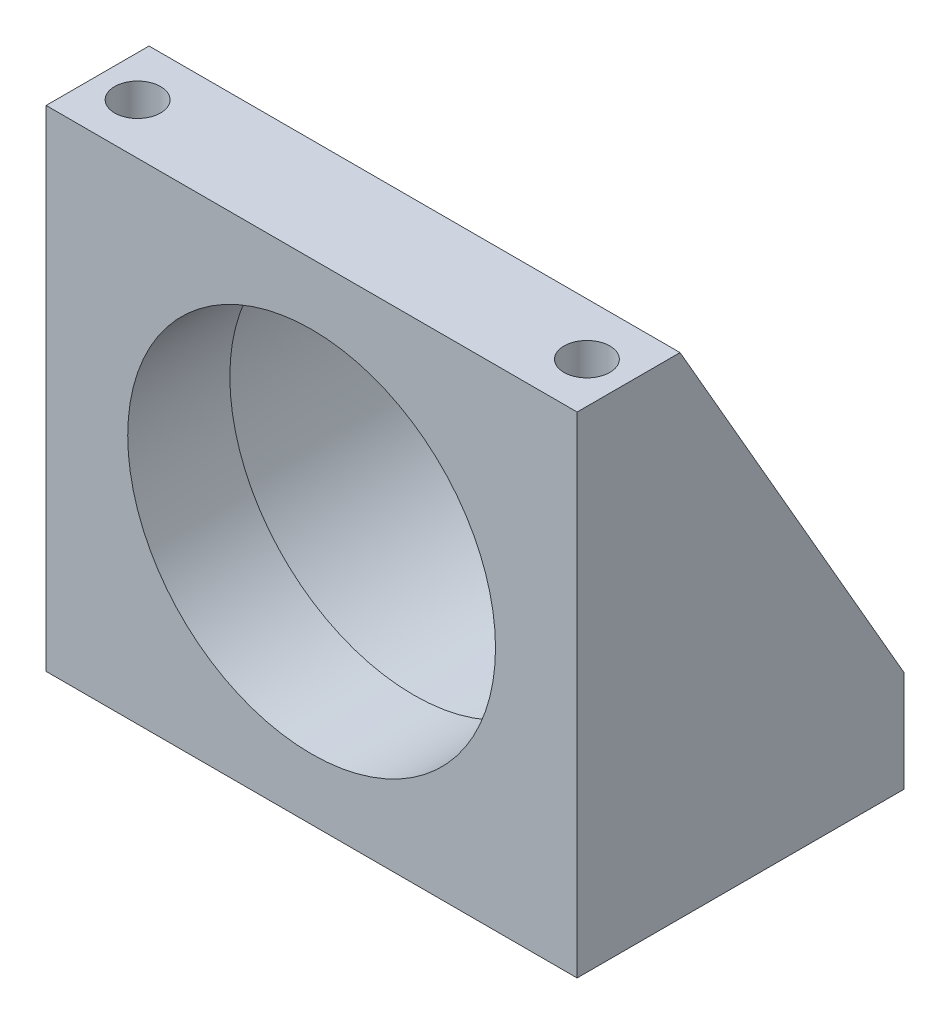
ISO-10303-21;
HEADER;
FILE_DESCRIPTION(('STEP AP214'),'2;1');
FILE_NAME('part.step','',(''),(''),'','','');
FILE_SCHEMA(('AUTOMOTIVE_DESIGN { 1 0 10303 214 1 1 1 1 }'));
ENDSEC;
DATA;
#1=APPLICATION_CONTEXT('core data for automotive mechanical design processes');
#2=APPLICATION_PROTOCOL_DEFINITION('international standard','automotive_design',2000,#1);
#3=PRODUCT_CONTEXT('',#1,'mechanical');
#4=PRODUCT('Part','Part','',(#3));
#5=PRODUCT_RELATED_PRODUCT_CATEGORY('part','',(#4));
#6=PRODUCT_DEFINITION_FORMATION('','',#4);
#7=PRODUCT_DEFINITION_CONTEXT('part definition',#1,'design');
#8=PRODUCT_DEFINITION('design','',#6,#7);
#9=PRODUCT_DEFINITION_SHAPE('','',#8);
#10=(LENGTH_UNIT() NAMED_UNIT(*) SI_UNIT(.MILLI.,.METRE.));
#11=(NAMED_UNIT(*) PLANE_ANGLE_UNIT() SI_UNIT($,.RADIAN.));
#12=(NAMED_UNIT(*) SI_UNIT($,.STERADIAN.) SOLID_ANGLE_UNIT());
#13=UNCERTAINTY_MEASURE_WITH_UNIT(LENGTH_MEASURE(1.E-05),#10,'distance_accuracy_value','');
#14=(GEOMETRIC_REPRESENTATION_CONTEXT(3) GLOBAL_UNCERTAINTY_ASSIGNED_CONTEXT((#13)) GLOBAL_UNIT_ASSIGNED_CONTEXT((#10,
#11,#12)) REPRESENTATION_CONTEXT('',''));
#15=CARTESIAN_POINT('',(0.,0.,0.));
#16=DIRECTION('',(0.,0.,1.));
#17=DIRECTION('',(1.,0.,0.));
#18=AXIS2_PLACEMENT_3D('',#15,#16,#17);
#19=CARTESIAN_POINT('',(-41.275,76.2,-50.8));
#20=DIRECTION('',(-1.,0.,0.));
#21=DIRECTION('',(0.,-1.,0.));
#22=AXIS2_PLACEMENT_3D('',#19,#20,#21);
#23=PLANE('',#22);
#24=DIRECTION('',(0.,-0.86667016874231,-0.498881567721414));
#25=VECTOR('',#24,1.);
#26=CARTESIAN_POINT('',(-41.275,76.2,-16.002));
#27=LINE('',#26,#25);
#28=CARTESIAN_POINT('',(-41.275,76.2,-16.002));
#29=VERTEX_POINT('',#28);
#30=CARTESIAN_POINT('',(-41.275,15.748,-50.8));
#31=VERTEX_POINT('',#30);
#32=EDGE_CURVE('E192',#29,#31,#27,.T.);
#33=ORIENTED_EDGE('',*,*,#32,.T.);
#34=DIRECTION('',(0.,-1.,0.));
#35=VECTOR('',#34,1.);
#36=CARTESIAN_POINT('',(-41.275,76.2,-50.8));
#37=LINE('',#36,#35);
#38=CARTESIAN_POINT('',(-41.275,0.,-50.8));
#39=VERTEX_POINT('',#38);
#40=EDGE_CURVE('E105',#31,#39,#37,.T.);
#41=ORIENTED_EDGE('',*,*,#40,.T.);
#42=DIRECTION('',(0.,0.,1.));
#43=VECTOR('',#42,1.);
#44=CARTESIAN_POINT('',(-41.275,0.,-50.8));
#45=LINE('',#44,#43);
#46=CARTESIAN_POINT('',(-41.275,0.,0.));
#47=VERTEX_POINT('',#46);
#48=EDGE_CURVE('E95',#39,#47,#45,.T.);
#49=ORIENTED_EDGE('',*,*,#48,.T.);
#50=DIRECTION('',(0.,-1.,0.));
#51=VECTOR('',#50,1.);
#52=CARTESIAN_POINT('',(-41.275,76.2,0.));
#53=LINE('',#52,#51);
#54=CARTESIAN_POINT('',(-41.275,76.2,0.));
#55=VERTEX_POINT('',#54);
#56=EDGE_CURVE('E93',#55,#47,#53,.T.);
#57=ORIENTED_EDGE('',*,*,#56,.F.);
#58=DIRECTION('',(0.,0.,1.));
#59=VECTOR('',#58,1.);
#60=CARTESIAN_POINT('',(-41.275,76.2,-50.8));
#61=LINE('',#60,#59);
#62=EDGE_CURVE('E78',#29,#55,#61,.T.);
#63=ORIENTED_EDGE('',*,*,#62,.F.);
#64=EDGE_LOOP('',(#33,#41,#49,#57,#63));
#65=FACE_BOUND('',#64,.T.);
#66=ADVANCED_FACE('F35',(#65),#23,.T.);
#67=CARTESIAN_POINT('',(-41.275,76.2,-50.8));
#68=DIRECTION('',(0.,1.,0.));
#69=DIRECTION('',(0.,0.,1.));
#70=AXIS2_PLACEMENT_3D('',#67,#68,#69);
#71=PLANE('',#70);
#72=CARTESIAN_POINT('',(-34.925,76.2,-7.874));
#73=DIRECTION('',(0.,1.,0.));
#74=DIRECTION('',(0.,0.,1.));
#75=AXIS2_PLACEMENT_3D('',#72,#73,#74);
#76=CIRCLE('',#75,3.56870000000001);
#77=CARTESIAN_POINT('',(-34.925,76.2,-4.30529999999998));
#78=VERTEX_POINT('',#77);
#79=EDGE_CURVE('E178',#78,#78,#76,.T.);
#80=ORIENTED_EDGE('',*,*,#79,.F.);
#81=EDGE_LOOP('',(#80));
#82=FACE_BOUND('',#81,.T.);
#83=CARTESIAN_POINT('',(34.925,76.2,-7.874));
#84=DIRECTION('',(0.,1.,0.));
#85=DIRECTION('',(0.,0.,1.));
#86=AXIS2_PLACEMENT_3D('',#83,#84,#85);
#87=CIRCLE('',#86,3.56870000000001);
#88=CARTESIAN_POINT('',(34.925,76.2,-4.30529999999998));
#89=VERTEX_POINT('',#88);
#90=EDGE_CURVE('E182',#89,#89,#87,.T.);
#91=ORIENTED_EDGE('',*,*,#90,.F.);
#92=EDGE_LOOP('',(#91));
#93=FACE_BOUND('',#92,.T.);
#94=DIRECTION('',(1.,0.,0.));
#95=VECTOR('',#94,1.);
#96=CARTESIAN_POINT('',(-41.275,76.2,-16.002));
#97=LINE('',#96,#95);
#98=CARTESIAN_POINT('',(41.275,76.2,-16.002));
#99=VERTEX_POINT('',#98);
#100=EDGE_CURVE('E86',#29,#99,#97,.T.);
#101=ORIENTED_EDGE('',*,*,#100,.F.);
#102=ORIENTED_EDGE('',*,*,#62,.T.);
#103=DIRECTION('',(-1.,0.,0.));
#104=VECTOR('',#103,1.);
#105=CARTESIAN_POINT('',(-41.275,76.2,0.));
#106=LINE('',#105,#104);
#107=CARTESIAN_POINT('',(41.275,76.2,0.));
#108=VERTEX_POINT('',#107);
#109=EDGE_CURVE('E83',#108,#55,#106,.T.);
#110=ORIENTED_EDGE('',*,*,#109,.F.);
#111=DIRECTION('',(0.,0.,1.));
#112=VECTOR('',#111,1.);
#113=CARTESIAN_POINT('',(41.275,76.2,-50.8));
#114=LINE('',#113,#112);
#115=EDGE_CURVE('E90',#99,#108,#114,.T.);
#116=ORIENTED_EDGE('',*,*,#115,.F.);
#117=EDGE_LOOP('',(#101,#102,#110,#116));
#118=FACE_BOUND('',#117,.T.);
#119=ADVANCED_FACE('F80',(#82,#93,#118),#71,.T.);
#120=CARTESIAN_POINT('',(41.275,76.2,-50.8));
#121=DIRECTION('',(1.,0.,0.));
#122=DIRECTION('',(0.,1.,0.));
#123=AXIS2_PLACEMENT_3D('',#120,#121,#122);
#124=PLANE('',#123);
#125=DIRECTION('',(0.,-0.86667016874231,-0.498881567721414));
#126=VECTOR('',#125,1.);
#127=CARTESIAN_POINT('',(41.275,76.2,-16.002));
#128=LINE('',#127,#126);
#129=CARTESIAN_POINT('',(41.275,15.748,-50.8));
#130=VERTEX_POINT('',#129);
#131=EDGE_CURVE('E119',#99,#130,#128,.T.);
#132=ORIENTED_EDGE('',*,*,#131,.F.);
#133=ORIENTED_EDGE('',*,*,#115,.T.);
#134=DIRECTION('',(0.,1.,0.));
#135=VECTOR('',#134,1.);
#136=CARTESIAN_POINT('',(41.275,76.2,0.));
#137=LINE('',#136,#135);
#138=CARTESIAN_POINT('',(41.275,0.,0.));
#139=VERTEX_POINT('',#138);
#140=EDGE_CURVE('E104',#139,#108,#137,.T.);
#141=ORIENTED_EDGE('',*,*,#140,.F.);
#142=DIRECTION('',(0.,0.,1.));
#143=VECTOR('',#142,1.);
#144=CARTESIAN_POINT('',(41.275,0.,-50.8));
#145=LINE('',#144,#143);
#146=CARTESIAN_POINT('',(41.275,0.,-50.8));
#147=VERTEX_POINT('',#146);
#148=EDGE_CURVE('E58',#147,#139,#145,.T.);
#149=ORIENTED_EDGE('',*,*,#148,.F.);
#150=DIRECTION('',(0.,1.,0.));
#151=VECTOR('',#150,1.);
#152=CARTESIAN_POINT('',(41.275,76.2,-50.8));
#153=LINE('',#152,#151);
#154=EDGE_CURVE('E115',#147,#130,#153,.T.);
#155=ORIENTED_EDGE('',*,*,#154,.T.);
#156=EDGE_LOOP('',(#132,#133,#141,#149,#155));
#157=FACE_BOUND('',#156,.T.);
#158=ADVANCED_FACE('F144',(#157),#124,.T.);
#159=CARTESIAN_POINT('',(-41.275,0.,-50.8));
#160=DIRECTION('',(0.,-1.,0.));
#161=DIRECTION('',(0.,0.,-1.));
#162=AXIS2_PLACEMENT_3D('',#159,#160,#161);
#163=PLANE('',#162);
#164=CARTESIAN_POINT('',(-34.925,0.,-7.874));
#165=DIRECTION('',(0.,-1.,0.));
#166=DIRECTION('',(0.,0.,-1.));
#167=AXIS2_PLACEMENT_3D('',#164,#165,#166);
#168=CIRCLE('',#167,3.56870000000001);
#169=CARTESIAN_POINT('',(-34.925,0.,-11.4427));
#170=VERTEX_POINT('',#169);
#171=EDGE_CURVE('E181',#170,#170,#168,.T.);
#172=ORIENTED_EDGE('',*,*,#171,.F.);
#173=EDGE_LOOP('',(#172));
#174=FACE_BOUND('',#173,.T.);
#175=CARTESIAN_POINT('',(34.925,0.,-7.874));
#176=DIRECTION('',(0.,-1.,0.));
#177=DIRECTION('',(0.,0.,-1.));
#178=AXIS2_PLACEMENT_3D('',#175,#176,#177);
#179=CIRCLE('',#178,3.56870000000001);
#180=CARTESIAN_POINT('',(34.925,0.,-11.4427));
#181=VERTEX_POINT('',#180);
#182=EDGE_CURVE('E185',#181,#181,#179,.T.);
#183=ORIENTED_EDGE('',*,*,#182,.F.);
#184=EDGE_LOOP('',(#183));
#185=FACE_BOUND('',#184,.T.);
#186=DIRECTION('',(1.,0.,0.));
#187=VECTOR('',#186,1.);
#188=CARTESIAN_POINT('',(-41.275,0.,0.));
#189=LINE('',#188,#187);
#190=EDGE_CURVE('E99',#47,#139,#189,.T.);
#191=ORIENTED_EDGE('',*,*,#190,.F.);
#192=ORIENTED_EDGE('',*,*,#48,.F.);
#193=DIRECTION('',(1.,0.,0.));
#194=VECTOR('',#193,1.);
#195=CARTESIAN_POINT('',(-41.275,0.,-50.8));
#196=LINE('',#195,#194);
#197=EDGE_CURVE('E107',#39,#147,#196,.T.);
#198=ORIENTED_EDGE('',*,*,#197,.T.);
#199=ORIENTED_EDGE('',*,*,#148,.T.);
#200=EDGE_LOOP('',(#191,#192,#198,#199));
#201=FACE_BOUND('',#200,.T.);
#202=ADVANCED_FACE('F148',(#174,#185,#201),#163,.T.);
#203=CARTESIAN_POINT('',(-41.275,0.,-50.8));
#204=DIRECTION('',(0.,0.,1.));
#205=DIRECTION('',(1.,0.,0.));
#206=AXIS2_PLACEMENT_3D('',#203,#204,#205);
#207=PLANE('',#206);
#208=DIRECTION('',(1.,0.,0.));
#209=VECTOR('',#208,1.);
#210=CARTESIAN_POINT('',(-41.275,15.748,-50.8));
#211=LINE('',#210,#209);
#212=CARTESIAN_POINT('',(-21.4626242570661,15.748,-50.8));
#213=VERTEX_POINT('',#212);
#214=EDGE_CURVE('E196',#31,#213,#211,.T.);
#215=ORIENTED_EDGE('',*,*,#214,.T.);
#216=CARTESIAN_POINT('',(0.,38.1,-50.8));
#217=DIRECTION('',(0.,0.,-1.));
#218=DIRECTION('',(-1.,0.,0.));
#219=AXIS2_PLACEMENT_3D('',#216,#217,#218);
#220=CIRCLE('',#219,30.988);
#221=CARTESIAN_POINT('',(21.4626242570661,15.748,-50.8));
#222=VERTEX_POINT('',#221);
#223=EDGE_CURVE('E49',#222,#213,#220,.T.);
#224=ORIENTED_EDGE('',*,*,#223,.F.);
#225=EDGE_CURVE('E199',#222,#130,#211,.T.);
#226=ORIENTED_EDGE('',*,*,#225,.T.);
#227=ORIENTED_EDGE('',*,*,#154,.F.);
#228=ORIENTED_EDGE('',*,*,#197,.F.);
#229=ORIENTED_EDGE('',*,*,#40,.F.);
#230=EDGE_LOOP('',(#215,#224,#226,#227,#228,#229));
#231=FACE_BOUND('',#230,.T.);
#232=ADVANCED_FACE('F151',(#231),#207,.F.);
#233=CARTESIAN_POINT('',(-41.275,0.,0.));
#234=DIRECTION('',(0.,0.,1.));
#235=DIRECTION('',(1.,0.,0.));
#236=AXIS2_PLACEMENT_3D('',#233,#234,#235);
#237=PLANE('',#236);
#238=CARTESIAN_POINT('',(0.,38.1,0.));
#239=DIRECTION('',(0.,0.,1.));
#240=DIRECTION('',(1.,0.,0.));
#241=AXIS2_PLACEMENT_3D('',#238,#239,#240);
#242=CIRCLE('',#241,28.5877);
#243=CARTESIAN_POINT('',(28.5877,38.1,0.));
#244=VERTEX_POINT('',#243);
#245=EDGE_CURVE('E100',#244,#244,#242,.T.);
#246=ORIENTED_EDGE('',*,*,#245,.F.);
#247=EDGE_LOOP('',(#246));
#248=FACE_BOUND('',#247,.T.);
#249=ORIENTED_EDGE('',*,*,#56,.T.);
#250=ORIENTED_EDGE('',*,*,#190,.T.);
#251=ORIENTED_EDGE('',*,*,#140,.T.);
#252=ORIENTED_EDGE('',*,*,#109,.T.);
#253=EDGE_LOOP('',(#249,#250,#251,#252));
#254=FACE_BOUND('',#253,.T.);
#255=ADVANCED_FACE('F103',(#248,#254),#237,.T.);
#256=CARTESIAN_POINT('',(0.,38.1,-50.8));
#257=DIRECTION('',(0.,0.,1.));
#258=DIRECTION('',(1.,0.,0.));
#259=AXIS2_PLACEMENT_3D('',#256,#257,#258);
#260=CYLINDRICAL_SURFACE('',#259,28.5877);
#261=CARTESIAN_POINT('',(0.,38.1,-15.875));
#262=DIRECTION('',(0.,0.,1.));
#263=DIRECTION('',(1.,0.,0.));
#264=AXIS2_PLACEMENT_3D('',#261,#262,#263);
#265=CIRCLE('',#264,28.5877);
#266=CARTESIAN_POINT('',(28.5877,38.1,-15.875));
#267=VERTEX_POINT('',#266);
#268=EDGE_CURVE('E117',#267,#267,#265,.F.);
#269=ORIENTED_EDGE('',*,*,#268,.T.);
#270=EDGE_LOOP('',(#269));
#271=FACE_BOUND('',#270,.T.);
#272=ORIENTED_EDGE('',*,*,#245,.T.);
#273=EDGE_LOOP('',(#272));
#274=FACE_BOUND('',#273,.T.);
#275=ADVANCED_FACE('F157',(#271,#274),#260,.F.);
#276=CARTESIAN_POINT('',(-41.275,76.2,-16.002));
#277=DIRECTION('',(0.,-0.498881567721414,0.86667016874231));
#278=DIRECTION('',(0.,-0.86667016874231,-0.498881567721414));
#279=AXIS2_PLACEMENT_3D('',#276,#277,#278);
#280=PLANE('',#279);
#281=ORIENTED_EDGE('',*,*,#225,.F.);
#282=CARTESIAN_POINT('',(0.,38.1,-37.933512605042));
#283=DIRECTION('',(0.,-0.498881567721414,0.86667016874231));
#284=DIRECTION('',(0.,-0.86667016874231,-0.498881567721414));
#285=AXIS2_PLACEMENT_3D('',#282,#283,#284);
#286=ELLIPSE('',#285,35.7552401335897,30.988);
#287=EDGE_CURVE('E89',#222,#213,#286,.T.);
#288=ORIENTED_EDGE('',*,*,#287,.T.);
#289=ORIENTED_EDGE('',*,*,#214,.F.);
#290=ORIENTED_EDGE('',*,*,#32,.F.);
#291=ORIENTED_EDGE('',*,*,#100,.T.);
#292=ORIENTED_EDGE('',*,*,#131,.T.);
#293=EDGE_LOOP('',(#281,#288,#289,#290,#291,#292));
#294=FACE_BOUND('',#293,.T.);
#295=ADVANCED_FACE('F164',(#294),#280,.F.);
#296=CARTESIAN_POINT('',(-41.275,0.,-15.875));
#297=DIRECTION('',(0.,0.,1.));
#298=DIRECTION('',(1.,0.,0.));
#299=AXIS2_PLACEMENT_3D('',#296,#297,#298);
#300=PLANE('',#299);
#301=CARTESIAN_POINT('',(0.,38.1,-15.875));
#302=DIRECTION('',(0.,0.,1.));
#303=DIRECTION('',(1.,0.,0.));
#304=AXIS2_PLACEMENT_3D('',#301,#302,#303);
#305=CIRCLE('',#304,29.464);
#306=CARTESIAN_POINT('',(29.464,38.1,-15.875));
#307=VERTEX_POINT('',#306);
#308=EDGE_CURVE('E43',#307,#307,#305,.F.);
#309=ORIENTED_EDGE('',*,*,#308,.T.);
#310=EDGE_LOOP('',(#309));
#311=FACE_BOUND('',#310,.T.);
#312=ORIENTED_EDGE('',*,*,#268,.F.);
#313=EDGE_LOOP('',(#312));
#314=FACE_BOUND('',#313,.T.);
#315=ADVANCED_FACE('F123',(#311,#314),#300,.F.);
#316=CARTESIAN_POINT('',(0.,38.1,87.647299741635));
#317=DIRECTION('',(0.,0.,-1.));
#318=DIRECTION('',(-1.,0.,0.));
#319=AXIS2_PLACEMENT_3D('',#316,#317,#318);
#320=CYLINDRICAL_SURFACE('',#319,30.988);
#321=CARTESIAN_POINT('',(0.,38.1,-17.399));
#322=DIRECTION('',(0.,0.,1.));
#323=DIRECTION('',(1.,0.,0.));
#324=AXIS2_PLACEMENT_3D('',#321,#322,#323);
#325=CIRCLE('',#324,30.988);
#326=CARTESIAN_POINT('',(30.988,38.1,-17.399));
#327=VERTEX_POINT('',#326);
#328=EDGE_CURVE('E12',#327,#327,#325,.T.);
#329=ORIENTED_EDGE('',*,*,#328,.T.);
#330=EDGE_LOOP('',(#329));
#331=FACE_BOUND('',#330,.T.);
#332=ORIENTED_EDGE('',*,*,#223,.T.);
#333=ORIENTED_EDGE('',*,*,#287,.F.);
#334=EDGE_LOOP('',(#332,#333));
#335=FACE_BOUND('',#334,.T.);
#336=ADVANCED_FACE('F128',(#331,#335),#320,.F.);
#337=CARTESIAN_POINT('',(0.,38.1,-17.399));
#338=DIRECTION('',(0.,0.,1.));
#339=DIRECTION('',(1.,0.,0.));
#340=AXIS2_PLACEMENT_3D('',#337,#338,#339);
#341=TOROIDAL_SURFACE('',#340,29.464,1.524);
#342=ORIENTED_EDGE('',*,*,#328,.F.);
#343=EDGE_LOOP('',(#342));
#344=FACE_BOUND('',#343,.T.);
#345=ORIENTED_EDGE('',*,*,#308,.F.);
#346=EDGE_LOOP('',(#345));
#347=FACE_BOUND('',#346,.T.);
#348=ADVANCED_FACE('F37',(#344,#347),#341,.F.);
#349=CARTESIAN_POINT('',(34.925,76.2,-7.874));
#350=DIRECTION('',(0.,1.,0.));
#351=DIRECTION('',(0.,0.,1.));
#352=AXIS2_PLACEMENT_3D('',#349,#350,#351);
#353=CYLINDRICAL_SURFACE('',#352,3.56870000000001);
#354=ORIENTED_EDGE('',*,*,#90,.T.);
#355=EDGE_LOOP('',(#354));
#356=FACE_BOUND('',#355,.T.);
#357=ORIENTED_EDGE('',*,*,#182,.T.);
#358=EDGE_LOOP('',(#357));
#359=FACE_BOUND('',#358,.T.);
#360=ADVANCED_FACE('F127',(#356,#359),#353,.F.);
#361=CARTESIAN_POINT('',(-34.925,76.2,-7.874));
#362=DIRECTION('',(0.,1.,0.));
#363=DIRECTION('',(0.,0.,1.));
#364=AXIS2_PLACEMENT_3D('',#361,#362,#363);
#365=CYLINDRICAL_SURFACE('',#364,3.56870000000001);
#366=ORIENTED_EDGE('',*,*,#79,.T.);
#367=EDGE_LOOP('',(#366));
#368=FACE_BOUND('',#367,.T.);
#369=ORIENTED_EDGE('',*,*,#171,.T.);
#370=EDGE_LOOP('',(#369));
#371=FACE_BOUND('',#370,.T.);
#372=ADVANCED_FACE('F134',(#368,#371),#365,.F.);
#373=CLOSED_SHELL('',(#66,#119,#158,#202,#232,#255,#275,#295,#315,#336,#348,#360,#372));
#374=MANIFOLD_SOLID_BREP('B2',#373);
#375=ADVANCED_BREP_SHAPE_REPRESENTATION('',(#18,#374),#14);
#376=SHAPE_DEFINITION_REPRESENTATION(#9,#375);
ENDSEC;
END-ISO-10303-21;
